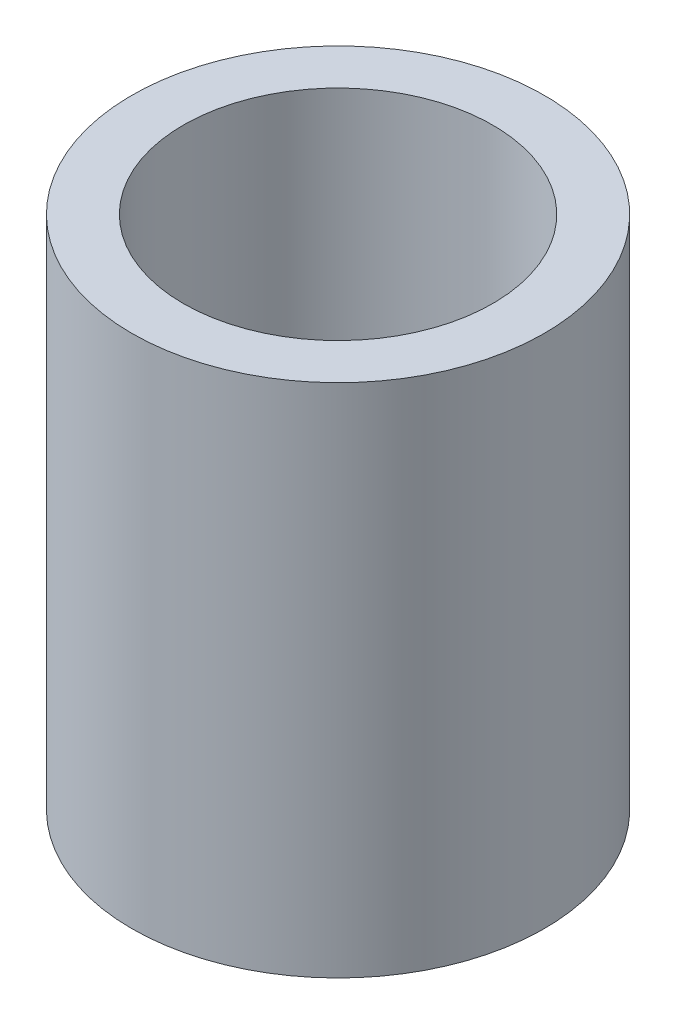
ISO-10303-21;
HEADER;
FILE_DESCRIPTION(('STEP AP214'),'2;1');
FILE_NAME('part.step','',(''),(''),'','','');
FILE_SCHEMA(('AUTOMOTIVE_DESIGN { 1 0 10303 214 1 1 1 1 }'));
ENDSEC;
DATA;
#1=APPLICATION_CONTEXT('core data for automotive mechanical design processes');
#2=APPLICATION_PROTOCOL_DEFINITION('international standard','automotive_design',2000,#1);
#3=PRODUCT_CONTEXT('',#1,'mechanical');
#4=PRODUCT('Part','Part','',(#3));
#5=PRODUCT_RELATED_PRODUCT_CATEGORY('part','',(#4));
#6=PRODUCT_DEFINITION_FORMATION('','',#4);
#7=PRODUCT_DEFINITION_CONTEXT('part definition',#1,'design');
#8=PRODUCT_DEFINITION('design','',#6,#7);
#9=PRODUCT_DEFINITION_SHAPE('','',#8);
#10=(LENGTH_UNIT() NAMED_UNIT(*) SI_UNIT(.MILLI.,.METRE.));
#11=(NAMED_UNIT(*) PLANE_ANGLE_UNIT() SI_UNIT($,.RADIAN.));
#12=(NAMED_UNIT(*) SI_UNIT($,.STERADIAN.) SOLID_ANGLE_UNIT());
#13=UNCERTAINTY_MEASURE_WITH_UNIT(LENGTH_MEASURE(1.E-05),#10,'distance_accuracy_value','');
#14=(GEOMETRIC_REPRESENTATION_CONTEXT(3) GLOBAL_UNCERTAINTY_ASSIGNED_CONTEXT((#13)) GLOBAL_UNIT_ASSIGNED_CONTEXT((#10,
#11,#12)) REPRESENTATION_CONTEXT('',''));
#15=CARTESIAN_POINT('',(0.,0.,0.));
#16=DIRECTION('',(0.,0.,1.));
#17=DIRECTION('',(1.,0.,0.));
#18=AXIS2_PLACEMENT_3D('',#15,#16,#17);
#19=CARTESIAN_POINT('',(0.,5.,0.));
#20=DIRECTION('',(0.,1.,0.));
#21=DIRECTION('',(0.,0.,1.));
#22=AXIS2_PLACEMENT_3D('',#19,#20,#21);
#23=PLANE('',#22);
#24=CARTESIAN_POINT('',(0.,5.,0.));
#25=DIRECTION('',(0.,1.,0.));
#26=DIRECTION('',(0.,0.,1.));
#27=AXIS2_PLACEMENT_3D('',#24,#25,#26);
#28=CIRCLE('',#27,2.);
#29=CARTESIAN_POINT('',(0.,5.,2.));
#30=VERTEX_POINT('',#29);
#31=EDGE_CURVE('E10',#30,#30,#28,.T.);
#32=ORIENTED_EDGE('',*,*,#31,.T.);
#33=EDGE_LOOP('',(#32));
#34=FACE_BOUND('',#33,.T.);
#35=CARTESIAN_POINT('',(0.,5.,0.));
#36=DIRECTION('',(0.,1.,0.));
#37=DIRECTION('',(0.,0.,1.));
#38=AXIS2_PLACEMENT_3D('',#35,#36,#37);
#39=CIRCLE('',#38,1.5);
#40=CARTESIAN_POINT('',(0.,5.,1.5));
#41=VERTEX_POINT('',#40);
#42=EDGE_CURVE('E50',#41,#41,#39,.T.);
#43=ORIENTED_EDGE('',*,*,#42,.F.);
#44=EDGE_LOOP('',(#43));
#45=FACE_BOUND('',#44,.T.);
#46=ADVANCED_FACE('F37',(#34,#45),#23,.T.);
#47=CARTESIAN_POINT('',(0.,0.,0.));
#48=DIRECTION('',(0.,1.,0.));
#49=DIRECTION('',(0.,0.,1.));
#50=AXIS2_PLACEMENT_3D('',#47,#48,#49);
#51=PLANE('',#50);
#52=CARTESIAN_POINT('',(0.,0.,0.));
#53=DIRECTION('',(0.,1.,0.));
#54=DIRECTION('',(0.,0.,1.));
#55=AXIS2_PLACEMENT_3D('',#52,#53,#54);
#56=CIRCLE('',#55,2.);
#57=CARTESIAN_POINT('',(0.,0.,2.));
#58=VERTEX_POINT('',#57);
#59=EDGE_CURVE('E41',#58,#58,#56,.T.);
#60=ORIENTED_EDGE('',*,*,#59,.F.);
#61=EDGE_LOOP('',(#60));
#62=FACE_BOUND('',#61,.T.);
#63=CARTESIAN_POINT('',(0.,0.,0.));
#64=DIRECTION('',(0.,1.,0.));
#65=DIRECTION('',(0.,0.,1.));
#66=AXIS2_PLACEMENT_3D('',#63,#64,#65);
#67=CIRCLE('',#66,1.5);
#68=CARTESIAN_POINT('',(0.,0.,1.5));
#69=VERTEX_POINT('',#68);
#70=EDGE_CURVE('E52',#69,#69,#67,.T.);
#71=ORIENTED_EDGE('',*,*,#70,.T.);
#72=EDGE_LOOP('',(#71));
#73=FACE_BOUND('',#72,.T.);
#74=ADVANCED_FACE('F64',(#62,#73),#51,.F.);
#75=CARTESIAN_POINT('',(0.,5.,0.));
#76=DIRECTION('',(0.,-1.,0.));
#77=DIRECTION('',(0.,0.,-1.));
#78=AXIS2_PLACEMENT_3D('',#75,#76,#77);
#79=CYLINDRICAL_SURFACE('',#78,2.);
#80=ORIENTED_EDGE('',*,*,#31,.F.);
#81=EDGE_LOOP('',(#80));
#82=FACE_BOUND('',#81,.T.);
#83=ORIENTED_EDGE('',*,*,#59,.T.);
#84=EDGE_LOOP('',(#83));
#85=FACE_BOUND('',#84,.T.);
#86=ADVANCED_FACE('F39',(#82,#85),#79,.T.);
#87=CARTESIAN_POINT('',(0.,5.,0.));
#88=DIRECTION('',(0.,-1.,0.));
#89=DIRECTION('',(0.,0.,-1.));
#90=AXIS2_PLACEMENT_3D('',#87,#88,#89);
#91=CYLINDRICAL_SURFACE('',#90,1.5);
#92=ORIENTED_EDGE('',*,*,#42,.T.);
#93=EDGE_LOOP('',(#92));
#94=FACE_BOUND('',#93,.T.);
#95=ORIENTED_EDGE('',*,*,#70,.F.);
#96=EDGE_LOOP('',(#95));
#97=FACE_BOUND('',#96,.T.);
#98=ADVANCED_FACE('F60',(#94,#97),#91,.F.);
#99=CLOSED_SHELL('',(#46,#74,#86,#98));
#100=MANIFOLD_SOLID_BREP('B2',#99);
#101=ADVANCED_BREP_SHAPE_REPRESENTATION('',(#18,#100),#14);
#102=SHAPE_DEFINITION_REPRESENTATION(#9,#101);
ENDSEC;
END-ISO-10303-21;
